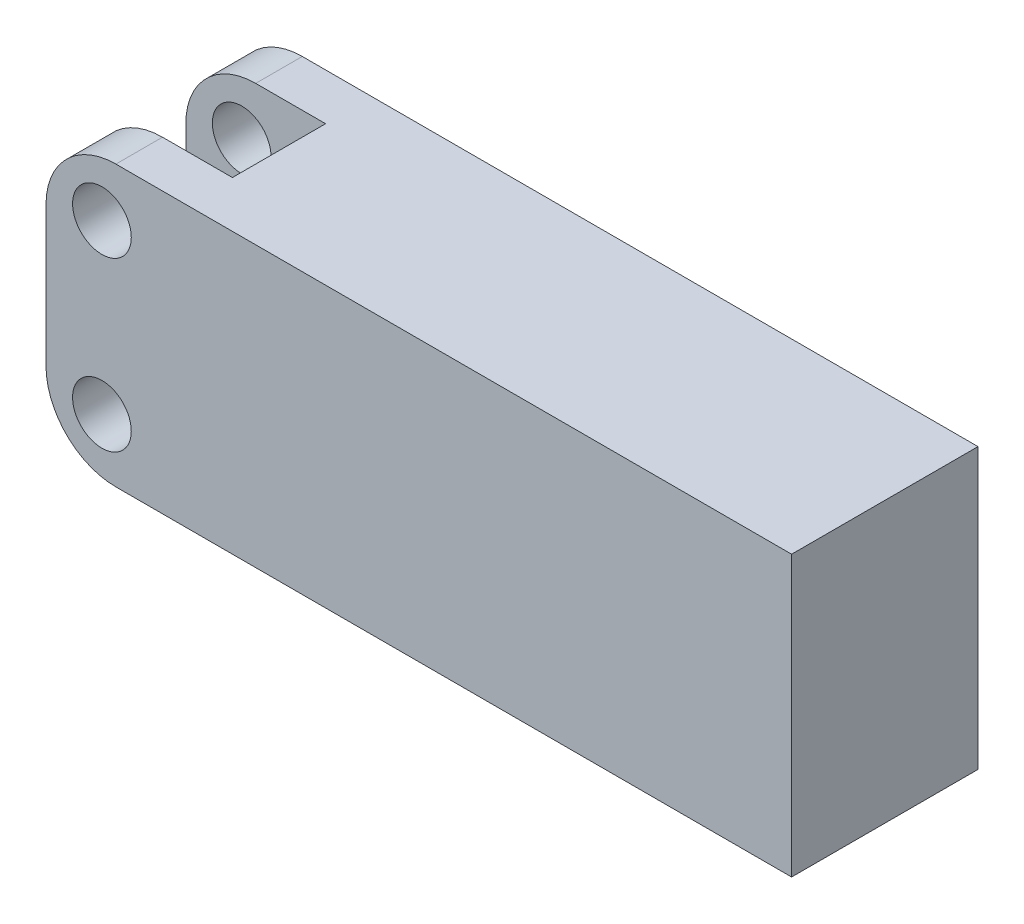
ISO-10303-21;
HEADER;
FILE_DESCRIPTION(('STEP AP214'),'2;1');
FILE_NAME('part.step','',(''),(''),'','','');
FILE_SCHEMA(('AUTOMOTIVE_DESIGN { 1 0 10303 214 1 1 1 1 }'));
ENDSEC;
DATA;
#1=APPLICATION_CONTEXT('core data for automotive mechanical design processes');
#2=APPLICATION_PROTOCOL_DEFINITION('international standard','automotive_design',2000,#1);
#3=PRODUCT_CONTEXT('',#1,'mechanical');
#4=PRODUCT('Part','Part','',(#3));
#5=PRODUCT_RELATED_PRODUCT_CATEGORY('part','',(#4));
#6=PRODUCT_DEFINITION_FORMATION('','',#4);
#7=PRODUCT_DEFINITION_CONTEXT('part definition',#1,'design');
#8=PRODUCT_DEFINITION('design','',#6,#7);
#9=PRODUCT_DEFINITION_SHAPE('','',#8);
#10=(LENGTH_UNIT() NAMED_UNIT(*) SI_UNIT(.MILLI.,.METRE.));
#11=(NAMED_UNIT(*) PLANE_ANGLE_UNIT() SI_UNIT($,.RADIAN.));
#12=(NAMED_UNIT(*) SI_UNIT($,.STERADIAN.) SOLID_ANGLE_UNIT());
#13=UNCERTAINTY_MEASURE_WITH_UNIT(LENGTH_MEASURE(1.E-05),#10,'distance_accuracy_value','');
#14=(GEOMETRIC_REPRESENTATION_CONTEXT(3) GLOBAL_UNCERTAINTY_ASSIGNED_CONTEXT((#13)) GLOBAL_UNIT_ASSIGNED_CONTEXT((#10,
#11,#12)) REPRESENTATION_CONTEXT('',''));
#15=CARTESIAN_POINT('',(0.,0.,0.));
#16=DIRECTION('',(0.,0.,1.));
#17=DIRECTION('',(1.,0.,0.));
#18=AXIS2_PLACEMENT_3D('',#15,#16,#17);
#19=CARTESIAN_POINT('',(3.81,15.24,12.7));
#20=DIRECTION('',(0.,0.,-1.));
#21=DIRECTION('',(-1.,0.,0.));
#22=AXIS2_PLACEMENT_3D('',#19,#20,#21);
#23=CYLINDRICAL_SURFACE('',#22,2.);
#24=CARTESIAN_POINT('',(3.81,15.24,0.));
#25=DIRECTION('',(0.,0.,1.));
#26=DIRECTION('',(1.,0.,0.));
#27=AXIS2_PLACEMENT_3D('',#24,#25,#26);
#28=CIRCLE('',#27,2.);
#29=CARTESIAN_POINT('',(5.81,15.24,0.));
#30=VERTEX_POINT('',#29);
#31=EDGE_CURVE('E174',#30,#30,#28,.T.);
#32=ORIENTED_EDGE('',*,*,#31,.F.);
#33=EDGE_LOOP('',(#32));
#34=FACE_BOUND('',#33,.T.);
#35=CARTESIAN_POINT('',(3.81,15.24,3.175));
#36=DIRECTION('',(0.,0.,1.));
#37=DIRECTION('',(1.,0.,0.));
#38=AXIS2_PLACEMENT_3D('',#35,#36,#37);
#39=CIRCLE('',#38,2.);
#40=CARTESIAN_POINT('',(5.81,15.24,3.175));
#41=VERTEX_POINT('',#40);
#42=EDGE_CURVE('E166',#41,#41,#39,.T.);
#43=ORIENTED_EDGE('',*,*,#42,.T.);
#44=EDGE_LOOP('',(#43));
#45=FACE_BOUND('',#44,.T.);
#46=ADVANCED_FACE('F38',(#34,#45),#23,.F.);
#47=CARTESIAN_POINT('',(0.,0.,12.7));
#48=DIRECTION('',(0.,0.,-1.));
#49=DIRECTION('',(-1.,0.,0.));
#50=AXIS2_PLACEMENT_3D('',#47,#48,#49);
#51=PLANE('',#50);
#52=DIRECTION('',(0.,-1.,0.));
#53=VECTOR('',#52,1.);
#54=CARTESIAN_POINT('',(0.,0.,12.7));
#55=LINE('',#54,#53);
#56=CARTESIAN_POINT('',(0.,14.2875,12.7));
#57=VERTEX_POINT('',#56);
#58=CARTESIAN_POINT('',(0.,4.7625,12.7));
#59=VERTEX_POINT('',#58);
#60=EDGE_CURVE('E184',#57,#59,#55,.T.);
#61=ORIENTED_EDGE('',*,*,#60,.T.);
#62=CARTESIAN_POINT('',(4.7625,4.7625,12.7));
#63=DIRECTION('',(0.,0.,-1.));
#64=DIRECTION('',(-1.,0.,0.));
#65=AXIS2_PLACEMENT_3D('',#62,#63,#64);
#66=CIRCLE('',#65,4.7625);
#67=CARTESIAN_POINT('',(4.7625,0.,12.7));
#68=VERTEX_POINT('',#67);
#69=EDGE_CURVE('E234',#59,#68,#66,.F.);
#70=ORIENTED_EDGE('',*,*,#69,.T.);
#71=DIRECTION('',(1.,0.,0.));
#72=VECTOR('',#71,1.);
#73=CARTESIAN_POINT('',(0.,0.,12.7));
#74=LINE('',#73,#72);
#75=CARTESIAN_POINT('',(50.8,0.,12.7));
#76=VERTEX_POINT('',#75);
#77=EDGE_CURVE('E187',#68,#76,#74,.T.);
#78=ORIENTED_EDGE('',*,*,#77,.T.);
#79=DIRECTION('',(0.,1.,0.));
#80=VECTOR('',#79,1.);
#81=CARTESIAN_POINT('',(50.8,0.,12.7));
#82=LINE('',#81,#80);
#83=CARTESIAN_POINT('',(50.8,19.05,12.7));
#84=VERTEX_POINT('',#83);
#85=EDGE_CURVE('E190',#76,#84,#82,.T.);
#86=ORIENTED_EDGE('',*,*,#85,.T.);
#87=DIRECTION('',(-1.,0.,0.));
#88=VECTOR('',#87,1.);
#89=CARTESIAN_POINT('',(0.,19.05,12.7));
#90=LINE('',#89,#88);
#91=CARTESIAN_POINT('',(4.7625,19.05,12.7));
#92=VERTEX_POINT('',#91);
#93=EDGE_CURVE('E192',#84,#92,#90,.T.);
#94=ORIENTED_EDGE('',*,*,#93,.T.);
#95=CARTESIAN_POINT('',(4.7625,14.2875,12.7));
#96=DIRECTION('',(0.,0.,-1.));
#97=DIRECTION('',(-1.,0.,0.));
#98=AXIS2_PLACEMENT_3D('',#95,#96,#97);
#99=CIRCLE('',#98,4.7625);
#100=EDGE_CURVE('E232',#92,#57,#99,.F.);
#101=ORIENTED_EDGE('',*,*,#100,.T.);
#102=EDGE_LOOP('',(#61,#70,#78,#86,#94,#101));
#103=FACE_BOUND('',#102,.T.);
#104=CARTESIAN_POINT('',(3.81,3.81,12.7));
#105=DIRECTION('',(0.,0.,1.));
#106=DIRECTION('',(1.,0.,0.));
#107=AXIS2_PLACEMENT_3D('',#104,#105,#106);
#108=CIRCLE('',#107,2.);
#109=CARTESIAN_POINT('',(5.81,3.81,12.7));
#110=VERTEX_POINT('',#109);
#111=EDGE_CURVE('E178',#110,#110,#108,.T.);
#112=ORIENTED_EDGE('',*,*,#111,.F.);
#113=EDGE_LOOP('',(#112));
#114=FACE_BOUND('',#113,.T.);
#115=CARTESIAN_POINT('',(3.81,15.24,12.7));
#116=DIRECTION('',(0.,0.,1.));
#117=DIRECTION('',(1.,0.,0.));
#118=AXIS2_PLACEMENT_3D('',#115,#116,#117);
#119=CIRCLE('',#118,2.);
#120=CARTESIAN_POINT('',(5.81,15.24,12.7));
#121=VERTEX_POINT('',#120);
#122=EDGE_CURVE('E170',#121,#121,#119,.T.);
#123=ORIENTED_EDGE('',*,*,#122,.F.);
#124=EDGE_LOOP('',(#123));
#125=FACE_BOUND('',#124,.T.);
#126=ADVANCED_FACE('F243',(#103,#114,#125),#51,.F.);
#127=CARTESIAN_POINT('',(0.,0.,0.));
#128=DIRECTION('',(0.,0.,-1.));
#129=DIRECTION('',(-1.,0.,0.));
#130=AXIS2_PLACEMENT_3D('',#127,#128,#129);
#131=PLANE('',#130);
#132=CARTESIAN_POINT('',(3.81,3.81,0.));
#133=DIRECTION('',(0.,0.,1.));
#134=DIRECTION('',(1.,0.,0.));
#135=AXIS2_PLACEMENT_3D('',#132,#133,#134);
#136=CIRCLE('',#135,2.);
#137=CARTESIAN_POINT('',(5.81,3.81,0.));
#138=VERTEX_POINT('',#137);
#139=EDGE_CURVE('E173',#138,#138,#136,.T.);
#140=ORIENTED_EDGE('',*,*,#139,.T.);
#141=EDGE_LOOP('',(#140));
#142=FACE_BOUND('',#141,.T.);
#143=DIRECTION('',(1.,0.,0.));
#144=VECTOR('',#143,1.);
#145=CARTESIAN_POINT('',(0.,0.,0.));
#146=LINE('',#145,#144);
#147=CARTESIAN_POINT('',(4.7625,0.,0.));
#148=VERTEX_POINT('',#147);
#149=CARTESIAN_POINT('',(50.8,0.,0.));
#150=VERTEX_POINT('',#149);
#151=EDGE_CURVE('E197',#148,#150,#146,.T.);
#152=ORIENTED_EDGE('',*,*,#151,.F.);
#153=CARTESIAN_POINT('',(4.7625,4.7625,0.));
#154=DIRECTION('',(0.,0.,-1.));
#155=DIRECTION('',(-1.,0.,0.));
#156=AXIS2_PLACEMENT_3D('',#153,#154,#155);
#157=CIRCLE('',#156,4.7625);
#158=CARTESIAN_POINT('',(0.,4.7625,0.));
#159=VERTEX_POINT('',#158);
#160=EDGE_CURVE('E224',#148,#159,#157,.T.);
#161=ORIENTED_EDGE('',*,*,#160,.T.);
#162=DIRECTION('',(0.,-1.,0.));
#163=VECTOR('',#162,1.);
#164=CARTESIAN_POINT('',(0.,0.,0.));
#165=LINE('',#164,#163);
#166=CARTESIAN_POINT('',(0.,14.2875,0.));
#167=VERTEX_POINT('',#166);
#168=EDGE_CURVE('E181',#167,#159,#165,.T.);
#169=ORIENTED_EDGE('',*,*,#168,.F.);
#170=CARTESIAN_POINT('',(4.7625,14.2875,0.));
#171=DIRECTION('',(0.,0.,-1.));
#172=DIRECTION('',(-1.,0.,0.));
#173=AXIS2_PLACEMENT_3D('',#170,#171,#172);
#174=CIRCLE('',#173,4.7625);
#175=CARTESIAN_POINT('',(4.7625,19.05,0.));
#176=VERTEX_POINT('',#175);
#177=EDGE_CURVE('E222',#167,#176,#174,.T.);
#178=ORIENTED_EDGE('',*,*,#177,.T.);
#179=DIRECTION('',(-1.,0.,0.));
#180=VECTOR('',#179,1.);
#181=CARTESIAN_POINT('',(0.,19.05,0.));
#182=LINE('',#181,#180);
#183=CARTESIAN_POINT('',(50.8,19.05,0.));
#184=VERTEX_POINT('',#183);
#185=EDGE_CURVE('E188',#184,#176,#182,.T.);
#186=ORIENTED_EDGE('',*,*,#185,.F.);
#187=DIRECTION('',(0.,1.,0.));
#188=VECTOR('',#187,1.);
#189=CARTESIAN_POINT('',(50.8,0.,0.));
#190=LINE('',#189,#188);
#191=EDGE_CURVE('E199',#150,#184,#190,.T.);
#192=ORIENTED_EDGE('',*,*,#191,.F.);
#193=EDGE_LOOP('',(#152,#161,#169,#178,#186,#192));
#194=FACE_BOUND('',#193,.T.);
#195=ORIENTED_EDGE('',*,*,#31,.T.);
#196=EDGE_LOOP('',(#195));
#197=FACE_BOUND('',#196,.T.);
#198=ADVANCED_FACE('F264',(#142,#194,#197),#131,.T.);
#199=CARTESIAN_POINT('',(0.,0.,12.7));
#200=DIRECTION('',(1.,0.,0.));
#201=DIRECTION('',(0.,0.,-1.));
#202=AXIS2_PLACEMENT_3D('',#199,#200,#201);
#203=PLANE('',#202);
#204=ORIENTED_EDGE('',*,*,#168,.T.);
#205=DIRECTION('',(0.,0.,-1.));
#206=VECTOR('',#205,1.);
#207=CARTESIAN_POINT('',(0.,4.7625,12.7));
#208=LINE('',#207,#206);
#209=EDGE_CURVE('E230',#159,#59,#208,.F.);
#210=ORIENTED_EDGE('',*,*,#209,.T.);
#211=ORIENTED_EDGE('',*,*,#60,.F.);
#212=DIRECTION('',(0.,0.,-1.));
#213=VECTOR('',#212,1.);
#214=CARTESIAN_POINT('',(0.,14.2875,12.7));
#215=LINE('',#214,#213);
#216=CARTESIAN_POINT('',(0.,14.2875,9.525));
#217=VERTEX_POINT('',#216);
#218=EDGE_CURVE('E228',#57,#217,#215,.T.);
#219=ORIENTED_EDGE('',*,*,#218,.T.);
#220=DIRECTION('',(0.,1.,0.));
#221=VECTOR('',#220,1.);
#222=CARTESIAN_POINT('',(0.,8.55,9.525));
#223=LINE('',#222,#221);
#224=CARTESIAN_POINT('',(0.,8.55,9.525));
#225=VERTEX_POINT('',#224);
#226=EDGE_CURVE('E137',#225,#217,#223,.T.);
#227=ORIENTED_EDGE('',*,*,#226,.F.);
#228=DIRECTION('',(0.,0.,1.));
#229=VECTOR('',#228,1.);
#230=CARTESIAN_POINT('',(0.,8.55,0.));
#231=LINE('',#230,#229);
#232=CARTESIAN_POINT('',(0.,8.55,3.175));
#233=VERTEX_POINT('',#232);
#234=EDGE_CURVE('E143',#233,#225,#231,.T.);
#235=ORIENTED_EDGE('',*,*,#234,.F.);
#236=DIRECTION('',(0.,1.,0.));
#237=VECTOR('',#236,1.);
#238=CARTESIAN_POINT('',(0.,8.55,3.175));
#239=LINE('',#238,#237);
#240=CARTESIAN_POINT('',(0.,14.2875,3.175));
#241=VERTEX_POINT('',#240);
#242=EDGE_CURVE('E127',#233,#241,#239,.T.);
#243=ORIENTED_EDGE('',*,*,#242,.T.);
#244=DIRECTION('',(0.,0.,-1.));
#245=VECTOR('',#244,1.);
#246=CARTESIAN_POINT('',(0.,14.2875,12.7));
#247=LINE('',#246,#245);
#248=EDGE_CURVE('E226',#241,#167,#247,.T.);
#249=ORIENTED_EDGE('',*,*,#248,.T.);
#250=EDGE_LOOP('',(#204,#210,#211,#219,#227,#235,#243,#249));
#251=FACE_BOUND('',#250,.T.);
#252=ADVANCED_FACE('F151',(#251),#203,.F.);
#253=CARTESIAN_POINT('',(0.,0.,12.7));
#254=DIRECTION('',(0.,1.,0.));
#255=DIRECTION('',(0.,0.,1.));
#256=AXIS2_PLACEMENT_3D('',#253,#254,#255);
#257=PLANE('',#256);
#258=ORIENTED_EDGE('',*,*,#77,.F.);
#259=DIRECTION('',(0.,0.,-1.));
#260=VECTOR('',#259,1.);
#261=CARTESIAN_POINT('',(4.7625,0.,12.7));
#262=LINE('',#261,#260);
#263=EDGE_CURVE('E219',#68,#148,#262,.T.);
#264=ORIENTED_EDGE('',*,*,#263,.T.);
#265=ORIENTED_EDGE('',*,*,#151,.T.);
#266=DIRECTION('',(0.,0.,-1.));
#267=VECTOR('',#266,1.);
#268=CARTESIAN_POINT('',(50.8,0.,12.7));
#269=LINE('',#268,#267);
#270=EDGE_CURVE('E204',#76,#150,#269,.T.);
#271=ORIENTED_EDGE('',*,*,#270,.F.);
#272=EDGE_LOOP('',(#258,#264,#265,#271));
#273=FACE_BOUND('',#272,.T.);
#274=ADVANCED_FACE('F274',(#273),#257,.F.);
#275=CARTESIAN_POINT('',(50.8,0.,12.7));
#276=DIRECTION('',(-1.,0.,0.));
#277=DIRECTION('',(0.,0.,1.));
#278=AXIS2_PLACEMENT_3D('',#275,#276,#277);
#279=PLANE('',#278);
#280=ORIENTED_EDGE('',*,*,#191,.T.);
#281=DIRECTION('',(0.,0.,-1.));
#282=VECTOR('',#281,1.);
#283=CARTESIAN_POINT('',(50.8,19.05,12.7));
#284=LINE('',#283,#282);
#285=EDGE_CURVE('E195',#84,#184,#284,.T.);
#286=ORIENTED_EDGE('',*,*,#285,.F.);
#287=ORIENTED_EDGE('',*,*,#85,.F.);
#288=ORIENTED_EDGE('',*,*,#270,.T.);
#289=EDGE_LOOP('',(#280,#286,#287,#288));
#290=FACE_BOUND('',#289,.T.);
#291=ADVANCED_FACE('F277',(#290),#279,.F.);
#292=CARTESIAN_POINT('',(0.,19.05,12.7));
#293=DIRECTION('',(0.,-1.,0.));
#294=DIRECTION('',(0.,0.,-1.));
#295=AXIS2_PLACEMENT_3D('',#292,#293,#294);
#296=PLANE('',#295);
#297=DIRECTION('',(1.,0.,0.));
#298=VECTOR('',#297,1.);
#299=CARTESIAN_POINT('',(0.,19.05,9.525));
#300=LINE('',#299,#298);
#301=CARTESIAN_POINT('',(4.7625,19.05,9.525));
#302=VERTEX_POINT('',#301);
#303=CARTESIAN_POINT('',(9.525,19.05,9.525));
#304=VERTEX_POINT('',#303);
#305=EDGE_CURVE('E147',#302,#304,#300,.T.);
#306=ORIENTED_EDGE('',*,*,#305,.F.);
#307=DIRECTION('',(0.,0.,-1.));
#308=VECTOR('',#307,1.);
#309=CARTESIAN_POINT('',(4.7625,19.05,12.7));
#310=LINE('',#309,#308);
#311=EDGE_CURVE('E46',#302,#92,#310,.F.);
#312=ORIENTED_EDGE('',*,*,#311,.T.);
#313=ORIENTED_EDGE('',*,*,#93,.F.);
#314=ORIENTED_EDGE('',*,*,#285,.T.);
#315=ORIENTED_EDGE('',*,*,#185,.T.);
#316=DIRECTION('',(0.,0.,-1.));
#317=VECTOR('',#316,1.);
#318=CARTESIAN_POINT('',(4.7625,19.05,12.7));
#319=LINE('',#318,#317);
#320=CARTESIAN_POINT('',(4.7625,19.05,3.175));
#321=VERTEX_POINT('',#320);
#322=EDGE_CURVE('E53',#176,#321,#319,.F.);
#323=ORIENTED_EDGE('',*,*,#322,.T.);
#324=DIRECTION('',(1.,0.,0.));
#325=VECTOR('',#324,1.);
#326=CARTESIAN_POINT('',(0.,19.05,3.175));
#327=LINE('',#326,#325);
#328=CARTESIAN_POINT('',(9.525,19.05,3.175));
#329=VERTEX_POINT('',#328);
#330=EDGE_CURVE('E160',#321,#329,#327,.T.);
#331=ORIENTED_EDGE('',*,*,#330,.T.);
#332=DIRECTION('',(0.,0.,1.));
#333=VECTOR('',#332,1.);
#334=CARTESIAN_POINT('',(9.525,19.05,0.));
#335=LINE('',#334,#333);
#336=EDGE_CURVE('E157',#329,#304,#335,.T.);
#337=ORIENTED_EDGE('',*,*,#336,.T.);
#338=EDGE_LOOP('',(#306,#312,#313,#314,#315,#323,#331,#337));
#339=FACE_BOUND('',#338,.T.);
#340=ADVANCED_FACE('F239',(#339),#296,.F.);
#341=CARTESIAN_POINT('',(3.81,3.81,12.7));
#342=DIRECTION('',(0.,0.,-1.));
#343=DIRECTION('',(-1.,0.,0.));
#344=AXIS2_PLACEMENT_3D('',#341,#342,#343);
#345=CYLINDRICAL_SURFACE('',#344,2.);
#346=ORIENTED_EDGE('',*,*,#111,.T.);
#347=EDGE_LOOP('',(#346));
#348=FACE_BOUND('',#347,.T.);
#349=ORIENTED_EDGE('',*,*,#139,.F.);
#350=EDGE_LOOP('',(#349));
#351=FACE_BOUND('',#350,.T.);
#352=ADVANCED_FACE('F284',(#348,#351),#345,.F.);
#353=CARTESIAN_POINT('',(3.81,15.24,9.525));
#354=DIRECTION('',(0.,0.,1.));
#355=DIRECTION('',(1.,0.,0.));
#356=AXIS2_PLACEMENT_3D('',#353,#354,#355);
#357=CIRCLE('',#356,2.);
#358=CARTESIAN_POINT('',(5.81,15.24,9.525));
#359=VERTEX_POINT('',#358);
#360=EDGE_CURVE('E177',#359,#359,#357,.T.);
#361=ORIENTED_EDGE('',*,*,#360,.F.);
#362=EDGE_LOOP('',(#361));
#363=FACE_BOUND('',#362,.T.);
#364=ORIENTED_EDGE('',*,*,#122,.T.);
#365=EDGE_LOOP('',(#364));
#366=FACE_BOUND('',#365,.T.);
#367=ADVANCED_FACE('F291',(#363,#366),#23,.F.);
#368=CARTESIAN_POINT('',(9.525,8.55,0.));
#369=DIRECTION('',(-1.,0.,0.));
#370=DIRECTION('',(0.,0.,1.));
#371=AXIS2_PLACEMENT_3D('',#368,#369,#370);
#372=PLANE('',#371);
#373=DIRECTION('',(0.,1.,0.));
#374=VECTOR('',#373,1.);
#375=CARTESIAN_POINT('',(9.525,8.55,3.175));
#376=LINE('',#375,#374);
#377=CARTESIAN_POINT('',(9.525,13.3125,3.175));
#378=VERTEX_POINT('',#377);
#379=EDGE_CURVE('E138',#378,#329,#376,.T.);
#380=ORIENTED_EDGE('',*,*,#379,.F.);
#381=DIRECTION('',(0.,0.,1.));
#382=VECTOR('',#381,1.);
#383=CARTESIAN_POINT('',(9.525,13.3125,9.525));
#384=LINE('',#383,#382);
#385=CARTESIAN_POINT('',(9.525,13.3125,9.525));
#386=VERTEX_POINT('',#385);
#387=EDGE_CURVE('E207',#378,#386,#384,.T.);
#388=ORIENTED_EDGE('',*,*,#387,.T.);
#389=DIRECTION('',(0.,1.,0.));
#390=VECTOR('',#389,1.);
#391=CARTESIAN_POINT('',(9.525,8.55,9.525));
#392=LINE('',#391,#390);
#393=EDGE_CURVE('E163',#386,#304,#392,.T.);
#394=ORIENTED_EDGE('',*,*,#393,.T.);
#395=ORIENTED_EDGE('',*,*,#336,.F.);
#396=EDGE_LOOP('',(#380,#388,#394,#395));
#397=FACE_BOUND('',#396,.T.);
#398=ADVANCED_FACE('F258',(#397),#372,.T.);
#399=CARTESIAN_POINT('',(0.,8.55,9.525));
#400=DIRECTION('',(0.,0.,1.));
#401=DIRECTION('',(1.,0.,0.));
#402=AXIS2_PLACEMENT_3D('',#399,#400,#401);
#403=PLANE('',#402);
#404=ORIENTED_EDGE('',*,*,#360,.T.);
#405=EDGE_LOOP('',(#404));
#406=FACE_BOUND('',#405,.T.);
#407=ORIENTED_EDGE('',*,*,#226,.T.);
#408=CARTESIAN_POINT('',(4.7625,14.2875,9.525));
#409=DIRECTION('',(0.,0.,1.));
#410=DIRECTION('',(1.,0.,0.));
#411=AXIS2_PLACEMENT_3D('',#408,#409,#410);
#412=CIRCLE('',#411,4.7625);
#413=EDGE_CURVE('E61',#217,#302,#412,.F.);
#414=ORIENTED_EDGE('',*,*,#413,.T.);
#415=ORIENTED_EDGE('',*,*,#305,.T.);
#416=ORIENTED_EDGE('',*,*,#393,.F.);
#417=CARTESIAN_POINT('',(4.7625,13.3125,9.525));
#418=DIRECTION('',(0.,0.,1.));
#419=DIRECTION('',(1.,0.,0.));
#420=AXIS2_PLACEMENT_3D('',#417,#418,#419);
#421=CIRCLE('',#420,4.7625);
#422=CARTESIAN_POINT('',(4.7625,8.55,9.525));
#423=VERTEX_POINT('',#422);
#424=EDGE_CURVE('E214',#386,#423,#421,.F.);
#425=ORIENTED_EDGE('',*,*,#424,.T.);
#426=DIRECTION('',(1.,0.,0.));
#427=VECTOR('',#426,1.);
#428=CARTESIAN_POINT('',(0.,8.55,9.525));
#429=LINE('',#428,#427);
#430=EDGE_CURVE('E153',#225,#423,#429,.T.);
#431=ORIENTED_EDGE('',*,*,#430,.F.);
#432=EDGE_LOOP('',(#407,#414,#415,#416,#425,#431));
#433=FACE_BOUND('',#432,.T.);
#434=ADVANCED_FACE('F250',(#406,#433),#403,.F.);
#435=CARTESIAN_POINT('',(0.,8.55,3.175));
#436=DIRECTION('',(0.,0.,1.));
#437=DIRECTION('',(1.,0.,0.));
#438=AXIS2_PLACEMENT_3D('',#435,#436,#437);
#439=PLANE('',#438);
#440=ORIENTED_EDGE('',*,*,#42,.F.);
#441=EDGE_LOOP('',(#440));
#442=FACE_BOUND('',#441,.T.);
#443=ORIENTED_EDGE('',*,*,#330,.F.);
#444=CARTESIAN_POINT('',(4.7625,14.2875,3.175));
#445=DIRECTION('',(0.,0.,1.));
#446=DIRECTION('',(1.,0.,0.));
#447=AXIS2_PLACEMENT_3D('',#444,#445,#446);
#448=CIRCLE('',#447,4.7625);
#449=EDGE_CURVE('E11',#321,#241,#448,.T.);
#450=ORIENTED_EDGE('',*,*,#449,.T.);
#451=ORIENTED_EDGE('',*,*,#242,.F.);
#452=DIRECTION('',(1.,0.,0.));
#453=VECTOR('',#452,1.);
#454=CARTESIAN_POINT('',(0.,8.55,3.175));
#455=LINE('',#454,#453);
#456=CARTESIAN_POINT('',(4.7625,8.55,3.175));
#457=VERTEX_POINT('',#456);
#458=EDGE_CURVE('E130',#233,#457,#455,.T.);
#459=ORIENTED_EDGE('',*,*,#458,.T.);
#460=CARTESIAN_POINT('',(4.7625,13.3125,3.175));
#461=DIRECTION('',(0.,0.,1.));
#462=DIRECTION('',(1.,0.,0.));
#463=AXIS2_PLACEMENT_3D('',#460,#461,#462);
#464=CIRCLE('',#463,4.7625);
#465=EDGE_CURVE('E217',#457,#378,#464,.T.);
#466=ORIENTED_EDGE('',*,*,#465,.T.);
#467=ORIENTED_EDGE('',*,*,#379,.T.);
#468=EDGE_LOOP('',(#443,#450,#451,#459,#466,#467));
#469=FACE_BOUND('',#468,.T.);
#470=ADVANCED_FACE('F129',(#442,#469),#439,.T.);
#471=CARTESIAN_POINT('',(0.,8.55,0.));
#472=DIRECTION('',(0.,1.,0.));
#473=DIRECTION('',(0.,0.,1.));
#474=AXIS2_PLACEMENT_3D('',#471,#472,#473);
#475=PLANE('',#474);
#476=ORIENTED_EDGE('',*,*,#430,.T.);
#477=DIRECTION('',(0.,0.,1.));
#478=VECTOR('',#477,1.);
#479=CARTESIAN_POINT('',(4.7625,8.55,3.175));
#480=LINE('',#479,#478);
#481=EDGE_CURVE('E146',#423,#457,#480,.F.);
#482=ORIENTED_EDGE('',*,*,#481,.T.);
#483=ORIENTED_EDGE('',*,*,#458,.F.);
#484=ORIENTED_EDGE('',*,*,#234,.T.);
#485=EDGE_LOOP('',(#476,#482,#483,#484));
#486=FACE_BOUND('',#485,.T.);
#487=ADVANCED_FACE('F142',(#486),#475,.T.);
#488=CARTESIAN_POINT('',(4.7625,13.3125,0.));
#489=DIRECTION('',(0.,0.,-1.));
#490=DIRECTION('',(-1.,0.,0.));
#491=AXIS2_PLACEMENT_3D('',#488,#489,#490);
#492=CYLINDRICAL_SURFACE('',#491,4.7625);
#493=ORIENTED_EDGE('',*,*,#465,.F.);
#494=ORIENTED_EDGE('',*,*,#481,.F.);
#495=ORIENTED_EDGE('',*,*,#424,.F.);
#496=ORIENTED_EDGE('',*,*,#387,.F.);
#497=EDGE_LOOP('',(#493,#494,#495,#496));
#498=FACE_BOUND('',#497,.T.);
#499=ADVANCED_FACE('F253',(#498),#492,.F.);
#500=CARTESIAN_POINT('',(4.7625,4.7625,12.7));
#501=DIRECTION('',(0.,0.,-1.));
#502=DIRECTION('',(-1.,0.,0.));
#503=AXIS2_PLACEMENT_3D('',#500,#501,#502);
#504=CYLINDRICAL_SURFACE('',#503,4.7625);
#505=ORIENTED_EDGE('',*,*,#69,.F.);
#506=ORIENTED_EDGE('',*,*,#209,.F.);
#507=ORIENTED_EDGE('',*,*,#160,.F.);
#508=ORIENTED_EDGE('',*,*,#263,.F.);
#509=EDGE_LOOP('',(#505,#506,#507,#508));
#510=FACE_BOUND('',#509,.T.);
#511=ADVANCED_FACE('F271',(#510),#504,.T.);
#512=CARTESIAN_POINT('',(4.7625,14.2875,12.7));
#513=DIRECTION('',(0.,0.,-1.));
#514=DIRECTION('',(-1.,0.,0.));
#515=AXIS2_PLACEMENT_3D('',#512,#513,#514);
#516=CYLINDRICAL_SURFACE('',#515,4.7625);
#517=ORIENTED_EDGE('',*,*,#100,.F.);
#518=ORIENTED_EDGE('',*,*,#311,.F.);
#519=ORIENTED_EDGE('',*,*,#413,.F.);
#520=ORIENTED_EDGE('',*,*,#218,.F.);
#521=EDGE_LOOP('',(#517,#518,#519,#520));
#522=FACE_BOUND('',#521,.T.);
#523=ADVANCED_FACE('F249',(#522),#516,.T.);
#524=CARTESIAN_POINT('',(4.7625,14.2875,12.7));
#525=DIRECTION('',(0.,0.,-1.));
#526=DIRECTION('',(-1.,0.,0.));
#527=AXIS2_PLACEMENT_3D('',#524,#525,#526);
#528=CYLINDRICAL_SURFACE('',#527,4.7625);
#529=ORIENTED_EDGE('',*,*,#449,.F.);
#530=ORIENTED_EDGE('',*,*,#322,.F.);
#531=ORIENTED_EDGE('',*,*,#177,.F.);
#532=ORIENTED_EDGE('',*,*,#248,.F.);
#533=EDGE_LOOP('',(#529,#530,#531,#532));
#534=FACE_BOUND('',#533,.T.);
#535=ADVANCED_FACE('F40',(#534),#528,.T.);
#536=CLOSED_SHELL('',(#46,#126,#198,#252,#274,#291,#340,#352,#367,#398,#434,#470,#487,#499,#511,
#523,#535));
#537=MANIFOLD_SOLID_BREP('B2',#536);
#538=ADVANCED_BREP_SHAPE_REPRESENTATION('',(#18,#537),#14);
#539=SHAPE_DEFINITION_REPRESENTATION(#9,#538);
ENDSEC;
END-ISO-10303-21;
